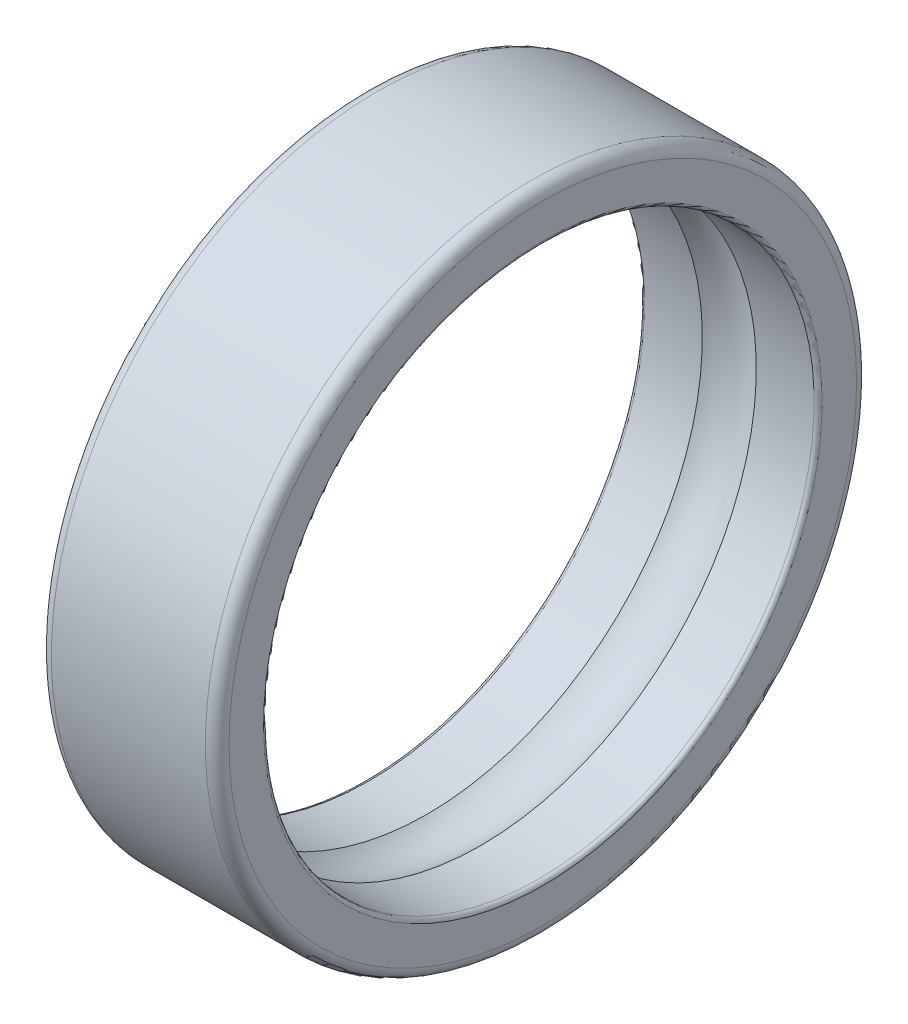
ISO-10303-21;
HEADER;
FILE_DESCRIPTION(('STEP AP214'),'2;1');
FILE_NAME('part.step','',(''),(''),'','','');
FILE_SCHEMA(('AUTOMOTIVE_DESIGN { 1 0 10303 214 1 1 1 1 }'));
ENDSEC;
DATA;
#1=APPLICATION_CONTEXT('core data for automotive mechanical design processes');
#2=APPLICATION_PROTOCOL_DEFINITION('international standard','automotive_design',2000,#1);
#3=PRODUCT_CONTEXT('',#1,'mechanical');
#4=PRODUCT('Part','Part','',(#3));
#5=PRODUCT_RELATED_PRODUCT_CATEGORY('part','',(#4));
#6=PRODUCT_DEFINITION_FORMATION('','',#4);
#7=PRODUCT_DEFINITION_CONTEXT('part definition',#1,'design');
#8=PRODUCT_DEFINITION('design','',#6,#7);
#9=PRODUCT_DEFINITION_SHAPE('','',#8);
#10=(LENGTH_UNIT() NAMED_UNIT(*) SI_UNIT(.MILLI.,.METRE.));
#11=(NAMED_UNIT(*) PLANE_ANGLE_UNIT() SI_UNIT($,.RADIAN.));
#12=(NAMED_UNIT(*) SI_UNIT($,.STERADIAN.) SOLID_ANGLE_UNIT());
#13=UNCERTAINTY_MEASURE_WITH_UNIT(LENGTH_MEASURE(1.E-05),#10,'distance_accuracy_value','');
#14=(GEOMETRIC_REPRESENTATION_CONTEXT(3) GLOBAL_UNCERTAINTY_ASSIGNED_CONTEXT((#13)) GLOBAL_UNIT_ASSIGNED_CONTEXT((#10,
#11,#12)) REPRESENTATION_CONTEXT('',''));
#15=CARTESIAN_POINT('',(0.,0.,0.));
#16=DIRECTION('',(0.,0.,1.));
#17=DIRECTION('',(1.,0.,0.));
#18=AXIS2_PLACEMENT_3D('',#15,#16,#17);
#19=CARTESIAN_POINT('',(0.,0.,0.));
#20=DIRECTION('',(1.,0.,0.));
#21=DIRECTION('',(0.,1.,0.));
#22=AXIS2_PLACEMENT_3D('',#19,#20,#21);
#23=TOROIDAL_SURFACE('',#22,4.,0.793999999999999);
#24=CARTESIAN_POINT('',(0.455999999999999,0.,0.));
#25=DIRECTION('',(-1.,0.,0.));
#26=DIRECTION('',(0.,-1.,0.));
#27=AXIS2_PLACEMENT_3D('',#24,#25,#26);
#28=CIRCLE('',#27,4.65);
#29=CARTESIAN_POINT('',(0.456000000000001,-4.65,0.));
#30=VERTEX_POINT('',#29);
#31=EDGE_CURVE('E135',#30,#30,#28,.F.);
#32=ORIENTED_EDGE('',*,*,#31,.T.);
#33=EDGE_LOOP('',(#32));
#34=FACE_BOUND('',#33,.T.);
#35=CARTESIAN_POINT('',(-0.456,0.,0.));
#36=DIRECTION('',(-1.,0.,0.));
#37=DIRECTION('',(0.,-1.,0.));
#38=AXIS2_PLACEMENT_3D('',#35,#36,#37);
#39=CIRCLE('',#38,4.65);
#40=CARTESIAN_POINT('',(-0.455999999999999,-4.65,0.));
#41=VERTEX_POINT('',#40);
#42=EDGE_CURVE('E142',#41,#41,#39,.T.);
#43=ORIENTED_EDGE('',*,*,#42,.T.);
#44=EDGE_LOOP('',(#43));
#45=FACE_BOUND('',#44,.T.);
#46=ADVANCED_FACE('F14',(#34,#45),#23,.F.);
#47=CARTESIAN_POINT('',(1.5,0.,0.));
#48=DIRECTION('',(-1.,0.,0.));
#49=DIRECTION('',(0.,-1.,0.));
#50=AXIS2_PLACEMENT_3D('',#47,#48,#49);
#51=CYLINDRICAL_SURFACE('',#50,4.65);
#52=CARTESIAN_POINT('',(-1.433333,0.,0.));
#53=DIRECTION('',(1.,0.,0.));
#54=DIRECTION('',(0.,1.,0.));
#55=AXIS2_PLACEMENT_3D('',#52,#53,#54);
#56=CIRCLE('',#55,4.65);
#57=CARTESIAN_POINT('',(-1.433333,4.65,0.));
#58=VERTEX_POINT('',#57);
#59=EDGE_CURVE('E108',#58,#58,#56,.T.);
#60=ORIENTED_EDGE('',*,*,#59,.F.);
#61=EDGE_LOOP('',(#60));
#62=FACE_BOUND('',#61,.T.);
#63=ORIENTED_EDGE('',*,*,#42,.F.);
#64=EDGE_LOOP('',(#63));
#65=FACE_BOUND('',#64,.T.);
#66=ADVANCED_FACE('F147',(#62,#65),#51,.F.);
#67=CARTESIAN_POINT('',(1.5,0.,0.));
#68=DIRECTION('',(-1.,0.,0.));
#69=DIRECTION('',(0.,-1.,0.));
#70=AXIS2_PLACEMENT_3D('',#67,#68,#69);
#71=CYLINDRICAL_SURFACE('',#70,4.65);
#72=ORIENTED_EDGE('',*,*,#31,.F.);
#73=EDGE_LOOP('',(#72));
#74=FACE_BOUND('',#73,.T.);
#75=CARTESIAN_POINT('',(1.433333,0.,0.));
#76=DIRECTION('',(1.,0.,0.));
#77=DIRECTION('',(0.,1.,0.));
#78=AXIS2_PLACEMENT_3D('',#75,#76,#77);
#79=CIRCLE('',#78,4.65);
#80=CARTESIAN_POINT('',(1.433333,4.65,0.));
#81=VERTEX_POINT('',#80);
#82=EDGE_CURVE('E105',#81,#81,#79,.F.);
#83=ORIENTED_EDGE('',*,*,#82,.F.);
#84=EDGE_LOOP('',(#83));
#85=FACE_BOUND('',#84,.T.);
#86=ADVANCED_FACE('F129',(#74,#85),#71,.F.);
#87=CARTESIAN_POINT('',(-1.433333,0.,0.));
#88=DIRECTION('',(1.,0.,0.));
#89=DIRECTION('',(0.,1.,0.));
#90=AXIS2_PLACEMENT_3D('',#87,#88,#89);
#91=TOROIDAL_SURFACE('',#90,4.716667,0.0666670000000009);
#92=CARTESIAN_POINT('',(-1.5,0.,0.));
#93=DIRECTION('',(-1.,0.,0.));
#94=DIRECTION('',(0.,1.,0.));
#95=AXIS2_PLACEMENT_3D('',#92,#93,#94);
#96=CIRCLE('',#95,4.716667);
#97=CARTESIAN_POINT('',(-1.5,4.716667,0.));
#98=VERTEX_POINT('',#97);
#99=EDGE_CURVE('E60',#98,#98,#96,.F.);
#100=ORIENTED_EDGE('',*,*,#99,.F.);
#101=EDGE_LOOP('',(#100));
#102=FACE_BOUND('',#101,.T.);
#103=ORIENTED_EDGE('',*,*,#59,.T.);
#104=EDGE_LOOP('',(#103));
#105=FACE_BOUND('',#104,.T.);
#106=ADVANCED_FACE('F125',(#102,#105),#91,.T.);
#107=CARTESIAN_POINT('',(1.433333,0.,0.));
#108=DIRECTION('',(1.,0.,0.));
#109=DIRECTION('',(0.,1.,0.));
#110=AXIS2_PLACEMENT_3D('',#107,#108,#109);
#111=TOROIDAL_SURFACE('',#110,4.716667,0.0666670000000003);
#112=ORIENTED_EDGE('',*,*,#82,.T.);
#113=EDGE_LOOP('',(#112));
#114=FACE_BOUND('',#113,.T.);
#115=CARTESIAN_POINT('',(1.5,0.,0.));
#116=DIRECTION('',(1.,0.,0.));
#117=DIRECTION('',(0.,1.,0.));
#118=AXIS2_PLACEMENT_3D('',#115,#116,#117);
#119=CIRCLE('',#118,4.716667);
#120=CARTESIAN_POINT('',(1.5,4.716667,0.));
#121=VERTEX_POINT('',#120);
#122=EDGE_CURVE('E113',#121,#121,#119,.F.);
#123=ORIENTED_EDGE('',*,*,#122,.F.);
#124=EDGE_LOOP('',(#123));
#125=FACE_BOUND('',#124,.T.);
#126=ADVANCED_FACE('F77',(#114,#125),#111,.T.);
#127=CARTESIAN_POINT('',(-1.5,5.3,0.));
#128=DIRECTION('',(-1.,0.,0.));
#129=DIRECTION('',(0.,-1.,0.));
#130=AXIS2_PLACEMENT_3D('',#127,#128,#129);
#131=PLANE('',#130);
#132=CARTESIAN_POINT('',(-1.5,0.,0.));
#133=DIRECTION('',(1.,0.,0.));
#134=DIRECTION('',(0.,1.,0.));
#135=AXIS2_PLACEMENT_3D('',#132,#133,#134);
#136=CIRCLE('',#135,5.3);
#137=CARTESIAN_POINT('',(-1.5,5.3,0.));
#138=VERTEX_POINT('',#137);
#139=EDGE_CURVE('E95',#138,#138,#136,.T.);
#140=ORIENTED_EDGE('',*,*,#139,.F.);
#141=EDGE_LOOP('',(#140));
#142=FACE_BOUND('',#141,.T.);
#143=ORIENTED_EDGE('',*,*,#99,.T.);
#144=EDGE_LOOP('',(#143));
#145=FACE_BOUND('',#144,.T.);
#146=ADVANCED_FACE('F67',(#142,#145),#131,.T.);
#147=CARTESIAN_POINT('',(1.5,4.716667,0.));
#148=DIRECTION('',(1.,0.,0.));
#149=DIRECTION('',(0.,0.,-1.));
#150=AXIS2_PLACEMENT_3D('',#147,#148,#149);
#151=PLANE('',#150);
#152=ORIENTED_EDGE('',*,*,#122,.T.);
#153=EDGE_LOOP('',(#152));
#154=FACE_BOUND('',#153,.T.);
#155=CARTESIAN_POINT('',(1.5,0.,0.));
#156=DIRECTION('',(-1.,0.,0.));
#157=DIRECTION('',(0.,1.,0.));
#158=AXIS2_PLACEMENT_3D('',#155,#156,#157);
#159=CIRCLE('',#158,5.3);
#160=CARTESIAN_POINT('',(1.5,5.3,0.));
#161=VERTEX_POINT('',#160);
#162=EDGE_CURVE('E26',#161,#161,#159,.T.);
#163=ORIENTED_EDGE('',*,*,#162,.F.);
#164=EDGE_LOOP('',(#163));
#165=FACE_BOUND('',#164,.T.);
#166=ADVANCED_FACE('F76',(#154,#165),#151,.T.);
#167=CARTESIAN_POINT('',(-1.3,0.,0.));
#168=DIRECTION('',(1.,0.,0.));
#169=DIRECTION('',(0.,1.,0.));
#170=AXIS2_PLACEMENT_3D('',#167,#168,#169);
#171=TOROIDAL_SURFACE('',#170,5.3,0.199999999999998);
#172=CARTESIAN_POINT('',(-1.3,0.,0.));
#173=DIRECTION('',(-1.,0.,0.));
#174=DIRECTION('',(0.,-1.,0.));
#175=AXIS2_PLACEMENT_3D('',#172,#173,#174);
#176=CIRCLE('',#175,5.5);
#177=CARTESIAN_POINT('',(-1.3,-5.5,0.));
#178=VERTEX_POINT('',#177);
#179=EDGE_CURVE('E21',#178,#178,#176,.F.);
#180=ORIENTED_EDGE('',*,*,#179,.F.);
#181=EDGE_LOOP('',(#180));
#182=FACE_BOUND('',#181,.T.);
#183=ORIENTED_EDGE('',*,*,#139,.T.);
#184=EDGE_LOOP('',(#183));
#185=FACE_BOUND('',#184,.T.);
#186=ADVANCED_FACE('F40',(#182,#185),#171,.T.);
#187=CARTESIAN_POINT('',(1.3,0.,0.));
#188=DIRECTION('',(1.,0.,0.));
#189=DIRECTION('',(0.,1.,0.));
#190=AXIS2_PLACEMENT_3D('',#187,#188,#189);
#191=TOROIDAL_SURFACE('',#190,5.3,0.199999999999999);
#192=ORIENTED_EDGE('',*,*,#162,.T.);
#193=EDGE_LOOP('',(#192));
#194=FACE_BOUND('',#193,.T.);
#195=CARTESIAN_POINT('',(1.3,0.,0.));
#196=DIRECTION('',(-1.,0.,0.));
#197=DIRECTION('',(0.,-1.,0.));
#198=AXIS2_PLACEMENT_3D('',#195,#196,#197);
#199=CIRCLE('',#198,5.5);
#200=CARTESIAN_POINT('',(1.3,-5.5,0.));
#201=VERTEX_POINT('',#200);
#202=EDGE_CURVE('E10',#201,#201,#199,.T.);
#203=ORIENTED_EDGE('',*,*,#202,.F.);
#204=EDGE_LOOP('',(#203));
#205=FACE_BOUND('',#204,.T.);
#206=ADVANCED_FACE('F34',(#194,#205),#191,.T.);
#207=CARTESIAN_POINT('',(1.5,0.,0.));
#208=DIRECTION('',(-1.,0.,0.));
#209=DIRECTION('',(0.,-1.,0.));
#210=AXIS2_PLACEMENT_3D('',#207,#208,#209);
#211=CYLINDRICAL_SURFACE('',#210,5.5);
#212=ORIENTED_EDGE('',*,*,#179,.T.);
#213=EDGE_LOOP('',(#212));
#214=FACE_BOUND('',#213,.T.);
#215=ORIENTED_EDGE('',*,*,#202,.T.);
#216=EDGE_LOOP('',(#215));
#217=FACE_BOUND('',#216,.T.);
#218=ADVANCED_FACE('F39',(#214,#217),#211,.T.);
#219=CLOSED_SHELL('',(#46,#66,#86,#106,#126,#146,#166,#186,#206,#218));
#220=MANIFOLD_SOLID_BREP('B1',#219);
#221=ADVANCED_BREP_SHAPE_REPRESENTATION('',(#18,#220),#14);
#222=SHAPE_DEFINITION_REPRESENTATION(#9,#221);
ENDSEC;
END-ISO-10303-21;
